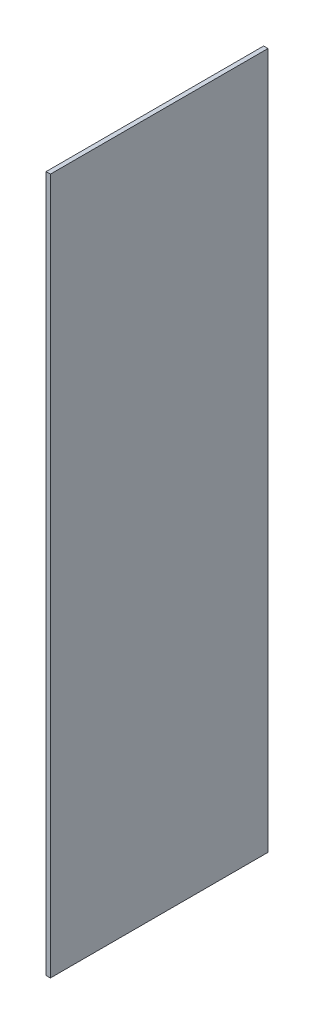
ISO-10303-21;
HEADER;
FILE_DESCRIPTION(('STEP AP214'),'2;1');
FILE_NAME('part.step','',(''),(''),'','','');
FILE_SCHEMA(('AUTOMOTIVE_DESIGN { 1 0 10303 214 1 1 1 1 }'));
ENDSEC;
DATA;
#1=APPLICATION_CONTEXT('core data for automotive mechanical design processes');
#2=APPLICATION_PROTOCOL_DEFINITION('international standard','automotive_design',2000,#1);
#3=PRODUCT_CONTEXT('',#1,'mechanical');
#4=PRODUCT('Part','Part','',(#3));
#5=PRODUCT_RELATED_PRODUCT_CATEGORY('part','',(#4));
#6=PRODUCT_DEFINITION_FORMATION('','',#4);
#7=PRODUCT_DEFINITION_CONTEXT('part definition',#1,'design');
#8=PRODUCT_DEFINITION('design','',#6,#7);
#9=PRODUCT_DEFINITION_SHAPE('','',#8);
#10=(LENGTH_UNIT() NAMED_UNIT(*) SI_UNIT(.MILLI.,.METRE.));
#11=(NAMED_UNIT(*) PLANE_ANGLE_UNIT() SI_UNIT($,.RADIAN.));
#12=(NAMED_UNIT(*) SI_UNIT($,.STERADIAN.) SOLID_ANGLE_UNIT());
#13=UNCERTAINTY_MEASURE_WITH_UNIT(LENGTH_MEASURE(1.E-05),#10,'distance_accuracy_value','');
#14=(GEOMETRIC_REPRESENTATION_CONTEXT(3) GLOBAL_UNCERTAINTY_ASSIGNED_CONTEXT((#13)) GLOBAL_UNIT_ASSIGNED_CONTEXT((#10,
#11,#12)) REPRESENTATION_CONTEXT('',''));
#15=CARTESIAN_POINT('',(0.,0.,0.));
#16=DIRECTION('',(0.,0.,1.));
#17=DIRECTION('',(1.,0.,0.));
#18=AXIS2_PLACEMENT_3D('',#15,#16,#17);
#19=CARTESIAN_POINT('',(0.,0.,5.));
#20=DIRECTION('',(1.,0.,0.));
#21=DIRECTION('',(0.,0.,-1.));
#22=AXIS2_PLACEMENT_3D('',#19,#20,#21);
#23=PLANE('',#22);
#24=DIRECTION('',(0.,-1.,0.));
#25=VECTOR('',#24,1.);
#26=CARTESIAN_POINT('',(0.,0.,0.));
#27=LINE('',#26,#25);
#28=CARTESIAN_POINT('',(0.,16.,0.));
#29=VERTEX_POINT('',#28);
#30=CARTESIAN_POINT('',(0.,0.,0.));
#31=VERTEX_POINT('',#30);
#32=EDGE_CURVE('E98',#29,#31,#27,.T.);
#33=ORIENTED_EDGE('',*,*,#32,.T.);
#34=DIRECTION('',(0.,0.,-1.));
#35=VECTOR('',#34,1.);
#36=CARTESIAN_POINT('',(0.,0.,5.));
#37=LINE('',#36,#35);
#38=CARTESIAN_POINT('',(0.,0.,5.));
#39=VERTEX_POINT('',#38);
#40=EDGE_CURVE('E11',#39,#31,#37,.T.);
#41=ORIENTED_EDGE('',*,*,#40,.F.);
#42=DIRECTION('',(0.,-1.,0.));
#43=VECTOR('',#42,1.);
#44=CARTESIAN_POINT('',(0.,0.,5.));
#45=LINE('',#44,#43);
#46=CARTESIAN_POINT('',(0.,16.,5.));
#47=VERTEX_POINT('',#46);
#48=EDGE_CURVE('E86',#47,#39,#45,.T.);
#49=ORIENTED_EDGE('',*,*,#48,.F.);
#50=DIRECTION('',(0.,0.,-1.));
#51=VECTOR('',#50,1.);
#52=CARTESIAN_POINT('',(0.,16.,5.));
#53=LINE('',#52,#51);
#54=EDGE_CURVE('E94',#47,#29,#53,.T.);
#55=ORIENTED_EDGE('',*,*,#54,.T.);
#56=EDGE_LOOP('',(#33,#41,#49,#55));
#57=FACE_BOUND('',#56,.T.);
#58=ADVANCED_FACE('F35',(#57),#23,.F.);
#59=CARTESIAN_POINT('',(0.,0.,5.));
#60=DIRECTION('',(0.,1.,0.));
#61=DIRECTION('',(0.,0.,1.));
#62=AXIS2_PLACEMENT_3D('',#59,#60,#61);
#63=PLANE('',#62);
#64=DIRECTION('',(1.,0.,0.));
#65=VECTOR('',#64,1.);
#66=CARTESIAN_POINT('',(0.,0.,0.));
#67=LINE('',#66,#65);
#68=CARTESIAN_POINT('',(0.1,0.,0.));
#69=VERTEX_POINT('',#68);
#70=EDGE_CURVE('E90',#31,#69,#67,.T.);
#71=ORIENTED_EDGE('',*,*,#70,.T.);
#72=DIRECTION('',(0.,0.,-1.));
#73=VECTOR('',#72,1.);
#74=CARTESIAN_POINT('',(0.1,0.,5.));
#75=LINE('',#74,#73);
#76=CARTESIAN_POINT('',(0.1,0.,5.));
#77=VERTEX_POINT('',#76);
#78=EDGE_CURVE('E43',#77,#69,#75,.T.);
#79=ORIENTED_EDGE('',*,*,#78,.F.);
#80=DIRECTION('',(1.,0.,0.));
#81=VECTOR('',#80,1.);
#82=CARTESIAN_POINT('',(0.,0.,5.));
#83=LINE('',#82,#81);
#84=EDGE_CURVE('E81',#39,#77,#83,.T.);
#85=ORIENTED_EDGE('',*,*,#84,.F.);
#86=ORIENTED_EDGE('',*,*,#40,.T.);
#87=EDGE_LOOP('',(#71,#79,#85,#86));
#88=FACE_BOUND('',#87,.T.);
#89=ADVANCED_FACE('F89',(#88),#63,.F.);
#90=CARTESIAN_POINT('',(0.1,0.,5.));
#91=DIRECTION('',(-1.,0.,0.));
#92=DIRECTION('',(0.,0.,1.));
#93=AXIS2_PLACEMENT_3D('',#90,#91,#92);
#94=PLANE('',#93);
#95=DIRECTION('',(0.,1.,0.));
#96=VECTOR('',#95,1.);
#97=CARTESIAN_POINT('',(0.1,0.,0.));
#98=LINE('',#97,#96);
#99=CARTESIAN_POINT('',(0.1,16.,0.));
#100=VERTEX_POINT('',#99);
#101=EDGE_CURVE('E68',#69,#100,#98,.T.);
#102=ORIENTED_EDGE('',*,*,#101,.T.);
#103=DIRECTION('',(0.,0.,-1.));
#104=VECTOR('',#103,1.);
#105=CARTESIAN_POINT('',(0.1,16.,5.));
#106=LINE('',#105,#104);
#107=CARTESIAN_POINT('',(0.1,16.,5.));
#108=VERTEX_POINT('',#107);
#109=EDGE_CURVE('E91',#108,#100,#106,.T.);
#110=ORIENTED_EDGE('',*,*,#109,.F.);
#111=DIRECTION('',(0.,1.,0.));
#112=VECTOR('',#111,1.);
#113=CARTESIAN_POINT('',(0.1,0.,5.));
#114=LINE('',#113,#112);
#115=EDGE_CURVE('E84',#77,#108,#114,.T.);
#116=ORIENTED_EDGE('',*,*,#115,.F.);
#117=ORIENTED_EDGE('',*,*,#78,.T.);
#118=EDGE_LOOP('',(#102,#110,#116,#117));
#119=FACE_BOUND('',#118,.T.);
#120=ADVANCED_FACE('F92',(#119),#94,.F.);
#121=CARTESIAN_POINT('',(0.,16.,5.));
#122=DIRECTION('',(0.,-1.,0.));
#123=DIRECTION('',(0.,0.,-1.));
#124=AXIS2_PLACEMENT_3D('',#121,#122,#123);
#125=PLANE('',#124);
#126=DIRECTION('',(-1.,0.,0.));
#127=VECTOR('',#126,1.);
#128=CARTESIAN_POINT('',(0.,16.,0.));
#129=LINE('',#128,#127);
#130=EDGE_CURVE('E74',#100,#29,#129,.T.);
#131=ORIENTED_EDGE('',*,*,#130,.T.);
#132=ORIENTED_EDGE('',*,*,#54,.F.);
#133=DIRECTION('',(-1.,0.,0.));
#134=VECTOR('',#133,1.);
#135=CARTESIAN_POINT('',(0.,16.,5.));
#136=LINE('',#135,#134);
#137=EDGE_CURVE('E51',#108,#47,#136,.T.);
#138=ORIENTED_EDGE('',*,*,#137,.F.);
#139=ORIENTED_EDGE('',*,*,#109,.T.);
#140=EDGE_LOOP('',(#131,#132,#138,#139));
#141=FACE_BOUND('',#140,.T.);
#142=ADVANCED_FACE('F105',(#141),#125,.F.);
#143=CARTESIAN_POINT('',(0.,0.,5.));
#144=DIRECTION('',(0.,0.,-1.));
#145=DIRECTION('',(-1.,0.,0.));
#146=AXIS2_PLACEMENT_3D('',#143,#144,#145);
#147=PLANE('',#146);
#148=ORIENTED_EDGE('',*,*,#48,.T.);
#149=ORIENTED_EDGE('',*,*,#84,.T.);
#150=ORIENTED_EDGE('',*,*,#115,.T.);
#151=ORIENTED_EDGE('',*,*,#137,.T.);
#152=EDGE_LOOP('',(#148,#149,#150,#151));
#153=FACE_BOUND('',#152,.T.);
#154=ADVANCED_FACE('F82',(#153),#147,.F.);
#155=CARTESIAN_POINT('',(0.,0.,0.));
#156=DIRECTION('',(0.,0.,-1.));
#157=DIRECTION('',(-1.,0.,0.));
#158=AXIS2_PLACEMENT_3D('',#155,#156,#157);
#159=PLANE('',#158);
#160=ORIENTED_EDGE('',*,*,#32,.F.);
#161=ORIENTED_EDGE('',*,*,#130,.F.);
#162=ORIENTED_EDGE('',*,*,#101,.F.);
#163=ORIENTED_EDGE('',*,*,#70,.F.);
#164=EDGE_LOOP('',(#160,#161,#162,#163));
#165=FACE_BOUND('',#164,.T.);
#166=ADVANCED_FACE('F108',(#165),#159,.T.);
#167=CLOSED_SHELL('',(#58,#89,#120,#142,#154,#166));
#168=MANIFOLD_SOLID_BREP('B2',#167);
#169=ADVANCED_BREP_SHAPE_REPRESENTATION('',(#18,#168),#14);
#170=SHAPE_DEFINITION_REPRESENTATION(#9,#169);
ENDSEC;
END-ISO-10303-21;
